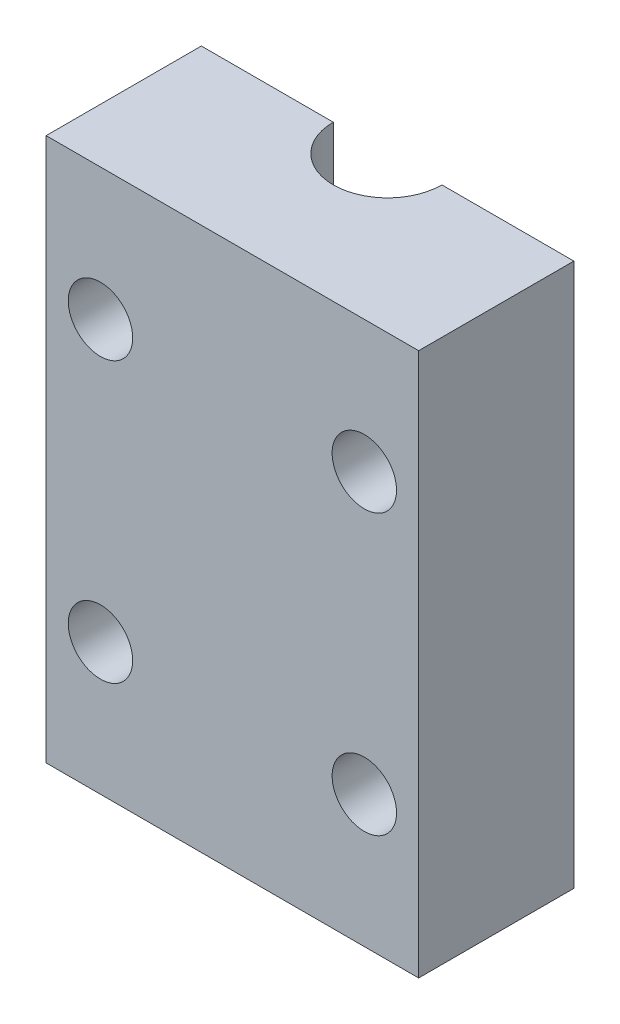
ISO-10303-21;
HEADER;
FILE_DESCRIPTION(('STEP AP214'),'2;1');
FILE_NAME('part.step','',(''),(''),'','','');
FILE_SCHEMA(('AUTOMOTIVE_DESIGN { 1 0 10303 214 1 1 1 1 }'));
ENDSEC;
DATA;
#1=APPLICATION_CONTEXT('core data for automotive mechanical design processes');
#2=APPLICATION_PROTOCOL_DEFINITION('international standard','automotive_design',2000,#1);
#3=PRODUCT_CONTEXT('',#1,'mechanical');
#4=PRODUCT('Part','Part','',(#3));
#5=PRODUCT_RELATED_PRODUCT_CATEGORY('part','',(#4));
#6=PRODUCT_DEFINITION_FORMATION('','',#4);
#7=PRODUCT_DEFINITION_CONTEXT('part definition',#1,'design');
#8=PRODUCT_DEFINITION('design','',#6,#7);
#9=PRODUCT_DEFINITION_SHAPE('','',#8);
#10=(LENGTH_UNIT() NAMED_UNIT(*) SI_UNIT(.MILLI.,.METRE.));
#11=(NAMED_UNIT(*) PLANE_ANGLE_UNIT() SI_UNIT($,.RADIAN.));
#12=(NAMED_UNIT(*) SI_UNIT($,.STERADIAN.) SOLID_ANGLE_UNIT());
#13=UNCERTAINTY_MEASURE_WITH_UNIT(LENGTH_MEASURE(1.E-05),#10,'distance_accuracy_value','');
#14=(GEOMETRIC_REPRESENTATION_CONTEXT(3) GLOBAL_UNCERTAINTY_ASSIGNED_CONTEXT((#13)) GLOBAL_UNIT_ASSIGNED_CONTEXT((#10,
#11,#12)) REPRESENTATION_CONTEXT('',''));
#15=CARTESIAN_POINT('',(0.,0.,0.));
#16=DIRECTION('',(0.,0.,1.));
#17=DIRECTION('',(1.,0.,0.));
#18=AXIS2_PLACEMENT_3D('',#15,#16,#17);
#19=CARTESIAN_POINT('',(24.,70.,-10.));
#20=DIRECTION('',(0.,0.,1.));
#21=DIRECTION('',(1.,0.,0.));
#22=AXIS2_PLACEMENT_3D('',#19,#20,#21);
#23=PLANE('',#22);
#24=CARTESIAN_POINT('',(-17.,53.,-10.));
#25=DIRECTION('',(0.,0.,1.));
#26=DIRECTION('',(1.,0.,0.));
#27=AXIS2_PLACEMENT_3D('',#24,#25,#26);
#28=CIRCLE('',#27,4.15);
#29=CARTESIAN_POINT('',(-12.85,53.,-10.));
#30=VERTEX_POINT('',#29);
#31=EDGE_CURVE('E129',#30,#30,#28,.T.);
#32=ORIENTED_EDGE('',*,*,#31,.T.);
#33=EDGE_LOOP('',(#32));
#34=FACE_BOUND('',#33,.T.);
#35=CARTESIAN_POINT('',(-17.,17.,-10.));
#36=DIRECTION('',(0.,0.,1.));
#37=DIRECTION('',(1.,0.,0.));
#38=AXIS2_PLACEMENT_3D('',#35,#36,#37);
#39=CIRCLE('',#38,4.15);
#40=CARTESIAN_POINT('',(-12.85,17.,-10.));
#41=VERTEX_POINT('',#40);
#42=EDGE_CURVE('E118',#41,#41,#39,.T.);
#43=ORIENTED_EDGE('',*,*,#42,.T.);
#44=EDGE_LOOP('',(#43));
#45=FACE_BOUND('',#44,.T.);
#46=DIRECTION('',(0.,-1.,0.));
#47=VECTOR('',#46,1.);
#48=CARTESIAN_POINT('',(-7.,266.501146782958,-10.));
#49=LINE('',#48,#47);
#50=CARTESIAN_POINT('',(-7.,70.,-10.));
#51=VERTEX_POINT('',#50);
#52=CARTESIAN_POINT('',(-7.,0.,-10.));
#53=VERTEX_POINT('',#52);
#54=EDGE_CURVE('E102',#51,#53,#49,.T.);
#55=ORIENTED_EDGE('',*,*,#54,.T.);
#56=DIRECTION('',(-1.,0.,0.));
#57=VECTOR('',#56,1.);
#58=CARTESIAN_POINT('',(24.,0.,-10.));
#59=LINE('',#58,#57);
#60=CARTESIAN_POINT('',(-24.,0.,-9.99999999999999));
#61=VERTEX_POINT('',#60);
#62=EDGE_CURVE('E89',#53,#61,#59,.T.);
#63=ORIENTED_EDGE('',*,*,#62,.T.);
#64=DIRECTION('',(0.,-1.,0.));
#65=VECTOR('',#64,1.);
#66=CARTESIAN_POINT('',(-24.,70.,-9.99999999999999));
#67=LINE('',#66,#65);
#68=CARTESIAN_POINT('',(-24.,70.,-9.99999999999999));
#69=VERTEX_POINT('',#68);
#70=EDGE_CURVE('E143',#69,#61,#67,.T.);
#71=ORIENTED_EDGE('',*,*,#70,.F.);
#72=DIRECTION('',(-1.,0.,0.));
#73=VECTOR('',#72,1.);
#74=CARTESIAN_POINT('',(24.,70.,-10.));
#75=LINE('',#74,#73);
#76=EDGE_CURVE('E103',#51,#69,#75,.T.);
#77=ORIENTED_EDGE('',*,*,#76,.F.);
#78=EDGE_LOOP('',(#55,#63,#71,#77));
#79=FACE_BOUND('',#78,.T.);
#80=ADVANCED_FACE('F35',(#34,#45,#79),#23,.F.);
#81=CARTESIAN_POINT('',(17.,17.,-10.));
#82=DIRECTION('',(0.,0.,1.));
#83=DIRECTION('',(1.,0.,0.));
#84=AXIS2_PLACEMENT_3D('',#81,#82,#83);
#85=CIRCLE('',#84,4.15);
#86=CARTESIAN_POINT('',(21.15,17.,-10.));
#87=VERTEX_POINT('',#86);
#88=EDGE_CURVE('E124',#87,#87,#85,.T.);
#89=ORIENTED_EDGE('',*,*,#88,.T.);
#90=EDGE_LOOP('',(#89));
#91=FACE_BOUND('',#90,.T.);
#92=CARTESIAN_POINT('',(17.,53.,-10.));
#93=DIRECTION('',(0.,0.,1.));
#94=DIRECTION('',(1.,0.,0.));
#95=AXIS2_PLACEMENT_3D('',#92,#93,#94);
#96=CIRCLE('',#95,4.15);
#97=CARTESIAN_POINT('',(21.15,53.,-10.));
#98=VERTEX_POINT('',#97);
#99=EDGE_CURVE('E111',#98,#98,#96,.T.);
#100=ORIENTED_EDGE('',*,*,#99,.T.);
#101=EDGE_LOOP('',(#100));
#102=FACE_BOUND('',#101,.T.);
#103=DIRECTION('',(0.,-1.,0.));
#104=VECTOR('',#103,1.);
#105=CARTESIAN_POINT('',(7.,266.501146782958,-10.));
#106=LINE('',#105,#104);
#107=CARTESIAN_POINT('',(7.,70.,-10.));
#108=VERTEX_POINT('',#107);
#109=CARTESIAN_POINT('',(7.,0.,-10.));
#110=VERTEX_POINT('',#109);
#111=EDGE_CURVE('E58',#108,#110,#106,.T.);
#112=ORIENTED_EDGE('',*,*,#111,.F.);
#113=CARTESIAN_POINT('',(24.,70.,-10.));
#114=VERTEX_POINT('',#113);
#115=EDGE_CURVE('E141',#114,#108,#75,.T.);
#116=ORIENTED_EDGE('',*,*,#115,.F.);
#117=DIRECTION('',(0.,-1.,0.));
#118=VECTOR('',#117,1.);
#119=CARTESIAN_POINT('',(24.,70.,-10.));
#120=LINE('',#119,#118);
#121=CARTESIAN_POINT('',(24.,0.,-10.));
#122=VERTEX_POINT('',#121);
#123=EDGE_CURVE('E149',#114,#122,#120,.T.);
#124=ORIENTED_EDGE('',*,*,#123,.T.);
#125=EDGE_CURVE('E98',#122,#110,#59,.T.);
#126=ORIENTED_EDGE('',*,*,#125,.T.);
#127=EDGE_LOOP('',(#112,#116,#124,#126));
#128=FACE_BOUND('',#127,.T.);
#129=ADVANCED_FACE('F167',(#91,#102,#128),#23,.F.);
#130=CARTESIAN_POINT('',(0.,70.,0.));
#131=DIRECTION('',(0.,1.,0.));
#132=DIRECTION('',(0.,0.,1.));
#133=AXIS2_PLACEMENT_3D('',#130,#131,#132);
#134=PLANE('',#133);
#135=ORIENTED_EDGE('',*,*,#115,.T.);
#136=CARTESIAN_POINT('',(0.,70.,-10.));
#137=DIRECTION('',(0.,1.,0.));
#138=DIRECTION('',(0.,0.,1.));
#139=AXIS2_PLACEMENT_3D('',#136,#137,#138);
#140=CIRCLE('',#139,7.);
#141=EDGE_CURVE('E50',#108,#51,#140,.F.);
#142=ORIENTED_EDGE('',*,*,#141,.T.);
#143=ORIENTED_EDGE('',*,*,#76,.T.);
#144=DIRECTION('',(0.,0.,1.));
#145=VECTOR('',#144,1.);
#146=CARTESIAN_POINT('',(-24.,70.,10.));
#147=LINE('',#146,#145);
#148=CARTESIAN_POINT('',(-24.,70.,10.));
#149=VERTEX_POINT('',#148);
#150=EDGE_CURVE('E134',#69,#149,#147,.T.);
#151=ORIENTED_EDGE('',*,*,#150,.T.);
#152=DIRECTION('',(1.,0.,0.));
#153=VECTOR('',#152,1.);
#154=CARTESIAN_POINT('',(24.,70.,10.));
#155=LINE('',#154,#153);
#156=CARTESIAN_POINT('',(24.,70.,10.));
#157=VERTEX_POINT('',#156);
#158=EDGE_CURVE('E137',#149,#157,#155,.T.);
#159=ORIENTED_EDGE('',*,*,#158,.T.);
#160=DIRECTION('',(0.,0.,-1.));
#161=VECTOR('',#160,1.);
#162=CARTESIAN_POINT('',(24.,70.,10.));
#163=LINE('',#162,#161);
#164=EDGE_CURVE('E139',#157,#114,#163,.T.);
#165=ORIENTED_EDGE('',*,*,#164,.T.);
#166=EDGE_LOOP('',(#135,#142,#143,#151,#159,#165));
#167=FACE_BOUND('',#166,.T.);
#168=ADVANCED_FACE('F161',(#167),#134,.T.);
#169=CARTESIAN_POINT('',(0.,0.,0.));
#170=DIRECTION('',(0.,1.,0.));
#171=DIRECTION('',(0.,0.,1.));
#172=AXIS2_PLACEMENT_3D('',#169,#170,#171);
#173=PLANE('',#172);
#174=CARTESIAN_POINT('',(0.,0.,-10.));
#175=DIRECTION('',(0.,1.,0.));
#176=DIRECTION('',(0.,0.,1.));
#177=AXIS2_PLACEMENT_3D('',#174,#175,#176);
#178=CIRCLE('',#177,7.);
#179=EDGE_CURVE('E11',#110,#53,#178,.F.);
#180=ORIENTED_EDGE('',*,*,#179,.F.);
#181=ORIENTED_EDGE('',*,*,#125,.F.);
#182=DIRECTION('',(0.,0.,-1.));
#183=VECTOR('',#182,1.);
#184=CARTESIAN_POINT('',(24.,0.,10.));
#185=LINE('',#184,#183);
#186=CARTESIAN_POINT('',(24.,0.,10.));
#187=VERTEX_POINT('',#186);
#188=EDGE_CURVE('E99',#187,#122,#185,.T.);
#189=ORIENTED_EDGE('',*,*,#188,.F.);
#190=DIRECTION('',(1.,0.,0.));
#191=VECTOR('',#190,1.);
#192=CARTESIAN_POINT('',(24.,0.,10.));
#193=LINE('',#192,#191);
#194=CARTESIAN_POINT('',(-24.,0.,10.));
#195=VERTEX_POINT('',#194);
#196=EDGE_CURVE('E145',#195,#187,#193,.T.);
#197=ORIENTED_EDGE('',*,*,#196,.F.);
#198=DIRECTION('',(0.,0.,1.));
#199=VECTOR('',#198,1.);
#200=CARTESIAN_POINT('',(-24.,0.,10.));
#201=LINE('',#200,#199);
#202=EDGE_CURVE('E94',#61,#195,#201,.T.);
#203=ORIENTED_EDGE('',*,*,#202,.F.);
#204=ORIENTED_EDGE('',*,*,#62,.F.);
#205=EDGE_LOOP('',(#180,#181,#189,#197,#203,#204));
#206=FACE_BOUND('',#205,.T.);
#207=ADVANCED_FACE('F91',(#206),#173,.F.);
#208=CARTESIAN_POINT('',(-24.,70.,10.));
#209=DIRECTION('',(1.,0.,0.));
#210=DIRECTION('',(0.,0.,-1.));
#211=AXIS2_PLACEMENT_3D('',#208,#209,#210);
#212=PLANE('',#211);
#213=ORIENTED_EDGE('',*,*,#202,.T.);
#214=DIRECTION('',(0.,-1.,0.));
#215=VECTOR('',#214,1.);
#216=CARTESIAN_POINT('',(-24.,70.,10.));
#217=LINE('',#216,#215);
#218=EDGE_CURVE('E43',#149,#195,#217,.T.);
#219=ORIENTED_EDGE('',*,*,#218,.F.);
#220=ORIENTED_EDGE('',*,*,#150,.F.);
#221=ORIENTED_EDGE('',*,*,#70,.T.);
#222=EDGE_LOOP('',(#213,#219,#220,#221));
#223=FACE_BOUND('',#222,.T.);
#224=ADVANCED_FACE('F37',(#223),#212,.F.);
#225=CARTESIAN_POINT('',(24.,70.,10.));
#226=DIRECTION('',(0.,0.,-1.));
#227=DIRECTION('',(-1.,0.,0.));
#228=AXIS2_PLACEMENT_3D('',#225,#226,#227);
#229=PLANE('',#228);
#230=CARTESIAN_POINT('',(17.,53.,10.));
#231=DIRECTION('',(0.,0.,1.));
#232=DIRECTION('',(1.,0.,0.));
#233=AXIS2_PLACEMENT_3D('',#230,#231,#232);
#234=CIRCLE('',#233,4.15);
#235=CARTESIAN_POINT('',(21.15,53.,10.));
#236=VERTEX_POINT('',#235);
#237=EDGE_CURVE('E115',#236,#236,#234,.T.);
#238=ORIENTED_EDGE('',*,*,#237,.F.);
#239=EDGE_LOOP('',(#238));
#240=FACE_BOUND('',#239,.T.);
#241=CARTESIAN_POINT('',(-17.,17.,10.));
#242=DIRECTION('',(0.,0.,1.));
#243=DIRECTION('',(1.,0.,0.));
#244=AXIS2_PLACEMENT_3D('',#241,#242,#243);
#245=CIRCLE('',#244,4.15);
#246=CARTESIAN_POINT('',(-12.85,17.,10.));
#247=VERTEX_POINT('',#246);
#248=EDGE_CURVE('E121',#247,#247,#245,.T.);
#249=ORIENTED_EDGE('',*,*,#248,.F.);
#250=EDGE_LOOP('',(#249));
#251=FACE_BOUND('',#250,.T.);
#252=CARTESIAN_POINT('',(17.,17.,10.));
#253=DIRECTION('',(0.,0.,1.));
#254=DIRECTION('',(1.,0.,0.));
#255=AXIS2_PLACEMENT_3D('',#252,#253,#254);
#256=CIRCLE('',#255,4.15);
#257=CARTESIAN_POINT('',(21.15,17.,10.));
#258=VERTEX_POINT('',#257);
#259=EDGE_CURVE('E108',#258,#258,#256,.T.);
#260=ORIENTED_EDGE('',*,*,#259,.F.);
#261=EDGE_LOOP('',(#260));
#262=FACE_BOUND('',#261,.T.);
#263=CARTESIAN_POINT('',(-17.,53.,10.));
#264=DIRECTION('',(0.,0.,1.));
#265=DIRECTION('',(1.,0.,0.));
#266=AXIS2_PLACEMENT_3D('',#263,#264,#265);
#267=CIRCLE('',#266,4.15);
#268=CARTESIAN_POINT('',(-12.85,53.,10.));
#269=VERTEX_POINT('',#268);
#270=EDGE_CURVE('E114',#269,#269,#267,.T.);
#271=ORIENTED_EDGE('',*,*,#270,.F.);
#272=EDGE_LOOP('',(#271));
#273=FACE_BOUND('',#272,.T.);
#274=ORIENTED_EDGE('',*,*,#196,.T.);
#275=DIRECTION('',(0.,-1.,0.));
#276=VECTOR('',#275,1.);
#277=CARTESIAN_POINT('',(24.,70.,10.));
#278=LINE('',#277,#276);
#279=EDGE_CURVE('E152',#157,#187,#278,.T.);
#280=ORIENTED_EDGE('',*,*,#279,.F.);
#281=ORIENTED_EDGE('',*,*,#158,.F.);
#282=ORIENTED_EDGE('',*,*,#218,.T.);
#283=EDGE_LOOP('',(#274,#280,#281,#282));
#284=FACE_BOUND('',#283,.T.);
#285=ADVANCED_FACE('F157',(#240,#251,#262,#273,#284),#229,.F.);
#286=CARTESIAN_POINT('',(24.,70.,10.));
#287=DIRECTION('',(-1.,0.,0.));
#288=DIRECTION('',(0.,0.,1.));
#289=AXIS2_PLACEMENT_3D('',#286,#287,#288);
#290=PLANE('',#289);
#291=ORIENTED_EDGE('',*,*,#188,.T.);
#292=ORIENTED_EDGE('',*,*,#123,.F.);
#293=ORIENTED_EDGE('',*,*,#164,.F.);
#294=ORIENTED_EDGE('',*,*,#279,.T.);
#295=EDGE_LOOP('',(#291,#292,#293,#294));
#296=FACE_BOUND('',#295,.T.);
#297=ADVANCED_FACE('F166',(#296),#290,.F.);
#298=CARTESIAN_POINT('',(-17.,53.,-10.));
#299=DIRECTION('',(0.,0.,1.));
#300=DIRECTION('',(1.,0.,0.));
#301=AXIS2_PLACEMENT_3D('',#298,#299,#300);
#302=CYLINDRICAL_SURFACE('',#301,4.15);
#303=ORIENTED_EDGE('',*,*,#31,.F.);
#304=EDGE_LOOP('',(#303));
#305=FACE_BOUND('',#304,.T.);
#306=ORIENTED_EDGE('',*,*,#270,.T.);
#307=EDGE_LOOP('',(#306));
#308=FACE_BOUND('',#307,.T.);
#309=ADVANCED_FACE('F181',(#305,#308),#302,.F.);
#310=CARTESIAN_POINT('',(17.,17.,-10.));
#311=DIRECTION('',(0.,0.,1.));
#312=DIRECTION('',(1.,0.,0.));
#313=AXIS2_PLACEMENT_3D('',#310,#311,#312);
#314=CYLINDRICAL_SURFACE('',#313,4.15);
#315=ORIENTED_EDGE('',*,*,#88,.F.);
#316=EDGE_LOOP('',(#315));
#317=FACE_BOUND('',#316,.T.);
#318=ORIENTED_EDGE('',*,*,#259,.T.);
#319=EDGE_LOOP('',(#318));
#320=FACE_BOUND('',#319,.T.);
#321=ADVANCED_FACE('F196',(#317,#320),#314,.F.);
#322=CARTESIAN_POINT('',(-17.,17.,-10.));
#323=DIRECTION('',(0.,0.,1.));
#324=DIRECTION('',(1.,0.,0.));
#325=AXIS2_PLACEMENT_3D('',#322,#323,#324);
#326=CYLINDRICAL_SURFACE('',#325,4.15);
#327=ORIENTED_EDGE('',*,*,#42,.F.);
#328=EDGE_LOOP('',(#327));
#329=FACE_BOUND('',#328,.T.);
#330=ORIENTED_EDGE('',*,*,#248,.T.);
#331=EDGE_LOOP('',(#330));
#332=FACE_BOUND('',#331,.T.);
#333=ADVANCED_FACE('F202',(#329,#332),#326,.F.);
#334=CARTESIAN_POINT('',(17.,53.,-10.));
#335=DIRECTION('',(0.,0.,1.));
#336=DIRECTION('',(1.,0.,0.));
#337=AXIS2_PLACEMENT_3D('',#334,#335,#336);
#338=CYLINDRICAL_SURFACE('',#337,4.15);
#339=ORIENTED_EDGE('',*,*,#99,.F.);
#340=EDGE_LOOP('',(#339));
#341=FACE_BOUND('',#340,.T.);
#342=ORIENTED_EDGE('',*,*,#237,.T.);
#343=EDGE_LOOP('',(#342));
#344=FACE_BOUND('',#343,.T.);
#345=ADVANCED_FACE('F209',(#341,#344),#338,.F.);
#346=CARTESIAN_POINT('',(0.,266.501146782958,-10.));
#347=DIRECTION('',(0.,-1.,0.));
#348=DIRECTION('',(0.,0.,-1.));
#349=AXIS2_PLACEMENT_3D('',#346,#347,#348);
#350=CYLINDRICAL_SURFACE('',#349,7.);
#351=ORIENTED_EDGE('',*,*,#141,.F.);
#352=ORIENTED_EDGE('',*,*,#111,.T.);
#353=ORIENTED_EDGE('',*,*,#179,.T.);
#354=ORIENTED_EDGE('',*,*,#54,.F.);
#355=EDGE_LOOP('',(#351,#352,#353,#354));
#356=FACE_BOUND('',#355,.T.);
#357=ADVANCED_FACE('F106',(#356),#350,.F.);
#358=CLOSED_SHELL('',(#80,#129,#168,#207,#224,#285,#297,#309,#321,#333,#345,#357));
#359=MANIFOLD_SOLID_BREP('B2',#358);
#360=ADVANCED_BREP_SHAPE_REPRESENTATION('',(#18,#359),#14);
#361=SHAPE_DEFINITION_REPRESENTATION(#9,#360);
ENDSEC;
END-ISO-10303-21;
